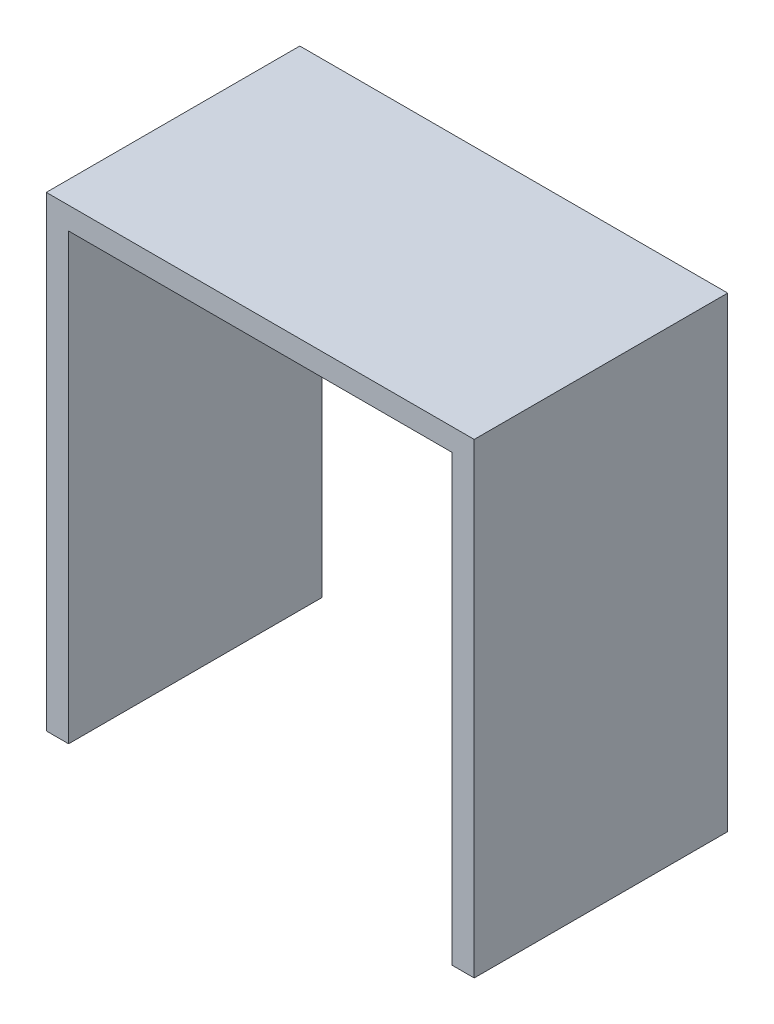
ISO-10303-21;
HEADER;
FILE_DESCRIPTION(('STEP AP214'),'2;1');
FILE_NAME('part.step','',(''),(''),'','','');
FILE_SCHEMA(('AUTOMOTIVE_DESIGN { 1 0 10303 214 1 1 1 1 }'));
ENDSEC;
DATA;
#1=APPLICATION_CONTEXT('core data for automotive mechanical design processes');
#2=APPLICATION_PROTOCOL_DEFINITION('international standard','automotive_design',2000,#1);
#3=PRODUCT_CONTEXT('',#1,'mechanical');
#4=PRODUCT('Part','Part','',(#3));
#5=PRODUCT_RELATED_PRODUCT_CATEGORY('part','',(#4));
#6=PRODUCT_DEFINITION_FORMATION('','',#4);
#7=PRODUCT_DEFINITION_CONTEXT('part definition',#1,'design');
#8=PRODUCT_DEFINITION('design','',#6,#7);
#9=PRODUCT_DEFINITION_SHAPE('','',#8);
#10=(LENGTH_UNIT() NAMED_UNIT(*) SI_UNIT(.MILLI.,.METRE.));
#11=(NAMED_UNIT(*) PLANE_ANGLE_UNIT() SI_UNIT($,.RADIAN.));
#12=(NAMED_UNIT(*) SI_UNIT($,.STERADIAN.) SOLID_ANGLE_UNIT());
#13=UNCERTAINTY_MEASURE_WITH_UNIT(LENGTH_MEASURE(1.E-05),#10,'distance_accuracy_value','');
#14=(GEOMETRIC_REPRESENTATION_CONTEXT(3) GLOBAL_UNCERTAINTY_ASSIGNED_CONTEXT((#13)) GLOBAL_UNIT_ASSIGNED_CONTEXT((#10,
#11,#12)) REPRESENTATION_CONTEXT('',''));
#15=CARTESIAN_POINT('',(0.,0.,0.));
#16=DIRECTION('',(0.,0.,1.));
#17=DIRECTION('',(1.,0.,0.));
#18=AXIS2_PLACEMENT_3D('',#15,#16,#17);
#19=CARTESIAN_POINT('',(2.20000000000001,0.,25.));
#20=DIRECTION('',(0.,1.,0.));
#21=DIRECTION('',(-1.,0.,0.));
#22=AXIS2_PLACEMENT_3D('',#19,#20,#21);
#23=PLANE('',#22);
#24=DIRECTION('',(1.,0.,0.));
#25=VECTOR('',#24,1.);
#26=CARTESIAN_POINT('',(2.20000000000001,0.,0.));
#27=LINE('',#26,#25);
#28=CARTESIAN_POINT('',(0.,0.,0.));
#29=VERTEX_POINT('',#28);
#30=CARTESIAN_POINT('',(2.20000000000001,0.,0.));
#31=VERTEX_POINT('',#30);
#32=EDGE_CURVE('E134',#29,#31,#27,.T.);
#33=ORIENTED_EDGE('',*,*,#32,.T.);
#34=DIRECTION('',(0.,0.,-1.));
#35=VECTOR('',#34,1.);
#36=CARTESIAN_POINT('',(2.20000000000001,0.,25.));
#37=LINE('',#36,#35);
#38=CARTESIAN_POINT('',(2.20000000000001,0.,25.));
#39=VERTEX_POINT('',#38);
#40=EDGE_CURVE('E11',#39,#31,#37,.T.);
#41=ORIENTED_EDGE('',*,*,#40,.F.);
#42=DIRECTION('',(1.,0.,0.));
#43=VECTOR('',#42,1.);
#44=CARTESIAN_POINT('',(2.20000000000001,0.,25.));
#45=LINE('',#44,#43);
#46=CARTESIAN_POINT('',(0.,0.,25.));
#47=VERTEX_POINT('',#46);
#48=EDGE_CURVE('E148',#47,#39,#45,.T.);
#49=ORIENTED_EDGE('',*,*,#48,.F.);
#50=DIRECTION('',(0.,0.,-1.));
#51=VECTOR('',#50,1.);
#52=CARTESIAN_POINT('',(0.,0.,25.));
#53=LINE('',#52,#51);
#54=EDGE_CURVE('E130',#47,#29,#53,.T.);
#55=ORIENTED_EDGE('',*,*,#54,.T.);
#56=EDGE_LOOP('',(#33,#41,#49,#55));
#57=FACE_BOUND('',#56,.T.);
#58=ADVANCED_FACE('F38',(#57),#23,.F.);
#59=CARTESIAN_POINT('',(2.2,43.8,25.));
#60=DIRECTION('',(-1.,0.,0.));
#61=DIRECTION('',(0.,-1.,0.));
#62=AXIS2_PLACEMENT_3D('',#59,#60,#61);
#63=PLANE('',#62);
#64=DIRECTION('',(0.,1.,0.));
#65=VECTOR('',#64,1.);
#66=CARTESIAN_POINT('',(2.2,43.8,0.));
#67=LINE('',#66,#65);
#68=CARTESIAN_POINT('',(2.2,43.8,0.));
#69=VERTEX_POINT('',#68);
#70=EDGE_CURVE('E137',#31,#69,#67,.T.);
#71=ORIENTED_EDGE('',*,*,#70,.T.);
#72=DIRECTION('',(0.,0.,-1.));
#73=VECTOR('',#72,1.);
#74=CARTESIAN_POINT('',(2.2,43.8,25.));
#75=LINE('',#74,#73);
#76=CARTESIAN_POINT('',(2.2,43.8,25.));
#77=VERTEX_POINT('',#76);
#78=EDGE_CURVE('E46',#77,#69,#75,.T.);
#79=ORIENTED_EDGE('',*,*,#78,.F.);
#80=DIRECTION('',(0.,1.,0.));
#81=VECTOR('',#80,1.);
#82=CARTESIAN_POINT('',(2.2,43.8,25.));
#83=LINE('',#82,#81);
#84=EDGE_CURVE('E97',#39,#77,#83,.T.);
#85=ORIENTED_EDGE('',*,*,#84,.F.);
#86=ORIENTED_EDGE('',*,*,#40,.T.);
#87=EDGE_LOOP('',(#71,#79,#85,#86));
#88=FACE_BOUND('',#87,.T.);
#89=ADVANCED_FACE('F183',(#88),#63,.F.);
#90=CARTESIAN_POINT('',(40.,43.8,25.));
#91=DIRECTION('',(0.,1.,0.));
#92=DIRECTION('',(-1.,0.,0.));
#93=AXIS2_PLACEMENT_3D('',#90,#91,#92);
#94=PLANE('',#93);
#95=DIRECTION('',(1.,0.,0.));
#96=VECTOR('',#95,1.);
#97=CARTESIAN_POINT('',(40.,43.8,0.));
#98=LINE('',#97,#96);
#99=CARTESIAN_POINT('',(40.,43.8,0.));
#100=VERTEX_POINT('',#99);
#101=EDGE_CURVE('E139',#69,#100,#98,.T.);
#102=ORIENTED_EDGE('',*,*,#101,.T.);
#103=DIRECTION('',(0.,0.,-1.));
#104=VECTOR('',#103,1.);
#105=CARTESIAN_POINT('',(40.,43.8,25.));
#106=LINE('',#105,#104);
#107=CARTESIAN_POINT('',(40.,43.8,25.));
#108=VERTEX_POINT('',#107);
#109=EDGE_CURVE('E155',#108,#100,#106,.T.);
#110=ORIENTED_EDGE('',*,*,#109,.F.);
#111=DIRECTION('',(1.,0.,0.));
#112=VECTOR('',#111,1.);
#113=CARTESIAN_POINT('',(40.,43.8,25.));
#114=LINE('',#113,#112);
#115=EDGE_CURVE('E163',#77,#108,#114,.T.);
#116=ORIENTED_EDGE('',*,*,#115,.F.);
#117=ORIENTED_EDGE('',*,*,#78,.T.);
#118=EDGE_LOOP('',(#102,#110,#116,#117));
#119=FACE_BOUND('',#118,.T.);
#120=ADVANCED_FACE('F161',(#119),#94,.F.);
#121=CARTESIAN_POINT('',(40.,0.,25.));
#122=DIRECTION('',(1.,0.,0.));
#123=DIRECTION('',(0.,0.,-1.));
#124=AXIS2_PLACEMENT_3D('',#121,#122,#123);
#125=PLANE('',#124);
#126=DIRECTION('',(0.,-1.,0.));
#127=VECTOR('',#126,1.);
#128=CARTESIAN_POINT('',(40.,0.,0.));
#129=LINE('',#128,#127);
#130=CARTESIAN_POINT('',(40.,0.,0.));
#131=VERTEX_POINT('',#130);
#132=EDGE_CURVE('E141',#100,#131,#129,.T.);
#133=ORIENTED_EDGE('',*,*,#132,.T.);
#134=DIRECTION('',(0.,0.,-1.));
#135=VECTOR('',#134,1.);
#136=CARTESIAN_POINT('',(40.,0.,25.));
#137=LINE('',#136,#135);
#138=CARTESIAN_POINT('',(40.,0.,25.));
#139=VERTEX_POINT('',#138);
#140=EDGE_CURVE('E152',#139,#131,#137,.T.);
#141=ORIENTED_EDGE('',*,*,#140,.F.);
#142=DIRECTION('',(0.,-1.,0.));
#143=VECTOR('',#142,1.);
#144=CARTESIAN_POINT('',(40.,0.,25.));
#145=LINE('',#144,#143);
#146=EDGE_CURVE('E175',#108,#139,#145,.T.);
#147=ORIENTED_EDGE('',*,*,#146,.F.);
#148=ORIENTED_EDGE('',*,*,#109,.T.);
#149=EDGE_LOOP('',(#133,#141,#147,#148));
#150=FACE_BOUND('',#149,.T.);
#151=ADVANCED_FACE('F171',(#150),#125,.F.);
#152=CARTESIAN_POINT('',(42.2,0.,25.));
#153=DIRECTION('',(0.,1.,0.));
#154=DIRECTION('',(-1.,0.,0.));
#155=AXIS2_PLACEMENT_3D('',#152,#153,#154);
#156=PLANE('',#155);
#157=DIRECTION('',(1.,0.,0.));
#158=VECTOR('',#157,1.);
#159=CARTESIAN_POINT('',(42.2,0.,0.));
#160=LINE('',#159,#158);
#161=CARTESIAN_POINT('',(42.2,0.,0.));
#162=VERTEX_POINT('',#161);
#163=EDGE_CURVE('E143',#131,#162,#160,.T.);
#164=ORIENTED_EDGE('',*,*,#163,.T.);
#165=DIRECTION('',(0.,0.,-1.));
#166=VECTOR('',#165,1.);
#167=CARTESIAN_POINT('',(42.2,0.,25.));
#168=LINE('',#167,#166);
#169=CARTESIAN_POINT('',(42.2,0.,25.));
#170=VERTEX_POINT('',#169);
#171=EDGE_CURVE('E125',#170,#162,#168,.T.);
#172=ORIENTED_EDGE('',*,*,#171,.F.);
#173=DIRECTION('',(1.,0.,0.));
#174=VECTOR('',#173,1.);
#175=CARTESIAN_POINT('',(42.2,0.,25.));
#176=LINE('',#175,#174);
#177=EDGE_CURVE('E116',#139,#170,#176,.T.);
#178=ORIENTED_EDGE('',*,*,#177,.F.);
#179=ORIENTED_EDGE('',*,*,#140,.T.);
#180=EDGE_LOOP('',(#164,#172,#178,#179));
#181=FACE_BOUND('',#180,.T.);
#182=ADVANCED_FACE('F174',(#181),#156,.F.);
#183=CARTESIAN_POINT('',(42.2,46.,25.));
#184=DIRECTION('',(-1.,0.,0.));
#185=DIRECTION('',(0.,-1.,0.));
#186=AXIS2_PLACEMENT_3D('',#183,#184,#185);
#187=PLANE('',#186);
#188=DIRECTION('',(0.,1.,0.));
#189=VECTOR('',#188,1.);
#190=CARTESIAN_POINT('',(42.2,46.,0.));
#191=LINE('',#190,#189);
#192=CARTESIAN_POINT('',(42.2,46.,0.));
#193=VERTEX_POINT('',#192);
#194=EDGE_CURVE('E124',#162,#193,#191,.T.);
#195=ORIENTED_EDGE('',*,*,#194,.T.);
#196=DIRECTION('',(0.,0.,-1.));
#197=VECTOR('',#196,1.);
#198=CARTESIAN_POINT('',(42.2,46.,25.));
#199=LINE('',#198,#197);
#200=CARTESIAN_POINT('',(42.2,46.,25.));
#201=VERTEX_POINT('',#200);
#202=EDGE_CURVE('E121',#201,#193,#199,.T.);
#203=ORIENTED_EDGE('',*,*,#202,.F.);
#204=DIRECTION('',(0.,1.,0.));
#205=VECTOR('',#204,1.);
#206=CARTESIAN_POINT('',(42.2,46.,25.));
#207=LINE('',#206,#205);
#208=EDGE_CURVE('E110',#170,#201,#207,.T.);
#209=ORIENTED_EDGE('',*,*,#208,.F.);
#210=ORIENTED_EDGE('',*,*,#171,.T.);
#211=EDGE_LOOP('',(#195,#203,#209,#210));
#212=FACE_BOUND('',#211,.T.);
#213=ADVANCED_FACE('F122',(#212),#187,.F.);
#214=CARTESIAN_POINT('',(0.,46.,25.));
#215=DIRECTION('',(0.,-1.,0.));
#216=DIRECTION('',(0.,0.,-1.));
#217=AXIS2_PLACEMENT_3D('',#214,#215,#216);
#218=PLANE('',#217);
#219=DIRECTION('',(-1.,0.,0.));
#220=VECTOR('',#219,1.);
#221=CARTESIAN_POINT('',(0.,46.,0.));
#222=LINE('',#221,#220);
#223=CARTESIAN_POINT('',(0.,46.,0.));
#224=VERTEX_POINT('',#223);
#225=EDGE_CURVE('E83',#193,#224,#222,.T.);
#226=ORIENTED_EDGE('',*,*,#225,.T.);
#227=DIRECTION('',(0.,0.,-1.));
#228=VECTOR('',#227,1.);
#229=CARTESIAN_POINT('',(0.,46.,25.));
#230=LINE('',#229,#228);
#231=CARTESIAN_POINT('',(0.,46.,25.));
#232=VERTEX_POINT('',#231);
#233=EDGE_CURVE('E126',#232,#224,#230,.T.);
#234=ORIENTED_EDGE('',*,*,#233,.F.);
#235=DIRECTION('',(-1.,0.,0.));
#236=VECTOR('',#235,1.);
#237=CARTESIAN_POINT('',(0.,46.,25.));
#238=LINE('',#237,#236);
#239=EDGE_CURVE('E114',#201,#232,#238,.T.);
#240=ORIENTED_EDGE('',*,*,#239,.F.);
#241=ORIENTED_EDGE('',*,*,#202,.T.);
#242=EDGE_LOOP('',(#226,#234,#240,#241));
#243=FACE_BOUND('',#242,.T.);
#244=ADVANCED_FACE('F128',(#243),#218,.F.);
#245=CARTESIAN_POINT('',(0.,0.,25.));
#246=DIRECTION('',(1.,0.,0.));
#247=DIRECTION('',(0.,0.,-1.));
#248=AXIS2_PLACEMENT_3D('',#245,#246,#247);
#249=PLANE('',#248);
#250=DIRECTION('',(0.,-1.,0.));
#251=VECTOR('',#250,1.);
#252=CARTESIAN_POINT('',(0.,0.,0.));
#253=LINE('',#252,#251);
#254=EDGE_CURVE('E89',#224,#29,#253,.T.);
#255=ORIENTED_EDGE('',*,*,#254,.T.);
#256=ORIENTED_EDGE('',*,*,#54,.F.);
#257=DIRECTION('',(0.,-1.,0.));
#258=VECTOR('',#257,1.);
#259=CARTESIAN_POINT('',(0.,0.,25.));
#260=LINE('',#259,#258);
#261=EDGE_CURVE('E54',#232,#47,#260,.T.);
#262=ORIENTED_EDGE('',*,*,#261,.F.);
#263=ORIENTED_EDGE('',*,*,#233,.T.);
#264=EDGE_LOOP('',(#255,#256,#262,#263));
#265=FACE_BOUND('',#264,.T.);
#266=ADVANCED_FACE('F199',(#265),#249,.F.);
#267=CARTESIAN_POINT('',(0.,0.,25.));
#268=DIRECTION('',(0.,0.,-1.));
#269=DIRECTION('',(-1.,0.,0.));
#270=AXIS2_PLACEMENT_3D('',#267,#268,#269);
#271=PLANE('',#270);
#272=ORIENTED_EDGE('',*,*,#48,.T.);
#273=ORIENTED_EDGE('',*,*,#84,.T.);
#274=ORIENTED_EDGE('',*,*,#115,.T.);
#275=ORIENTED_EDGE('',*,*,#146,.T.);
#276=ORIENTED_EDGE('',*,*,#177,.T.);
#277=ORIENTED_EDGE('',*,*,#208,.T.);
#278=ORIENTED_EDGE('',*,*,#239,.T.);
#279=ORIENTED_EDGE('',*,*,#261,.T.);
#280=EDGE_LOOP('',(#272,#273,#274,#275,#276,#277,#278,#279));
#281=FACE_BOUND('',#280,.T.);
#282=ADVANCED_FACE('F112',(#281),#271,.F.);
#283=CARTESIAN_POINT('',(0.,0.,0.));
#284=DIRECTION('',(0.,0.,-1.));
#285=DIRECTION('',(-1.,0.,0.));
#286=AXIS2_PLACEMENT_3D('',#283,#284,#285);
#287=PLANE('',#286);
#288=ORIENTED_EDGE('',*,*,#32,.F.);
#289=ORIENTED_EDGE('',*,*,#254,.F.);
#290=ORIENTED_EDGE('',*,*,#225,.F.);
#291=ORIENTED_EDGE('',*,*,#194,.F.);
#292=ORIENTED_EDGE('',*,*,#163,.F.);
#293=ORIENTED_EDGE('',*,*,#132,.F.);
#294=ORIENTED_EDGE('',*,*,#101,.F.);
#295=ORIENTED_EDGE('',*,*,#70,.F.);
#296=EDGE_LOOP('',(#288,#289,#290,#291,#292,#293,#294,#295));
#297=FACE_BOUND('',#296,.T.);
#298=ADVANCED_FACE('F167',(#297),#287,.T.);
#299=CLOSED_SHELL('',(#58,#89,#120,#151,#182,#213,#244,#266,#282,#298));
#300=MANIFOLD_SOLID_BREP('B2',#299);
#301=ADVANCED_BREP_SHAPE_REPRESENTATION('',(#18,#300),#14);
#302=SHAPE_DEFINITION_REPRESENTATION(#9,#301);
ENDSEC;
END-ISO-10303-21;
